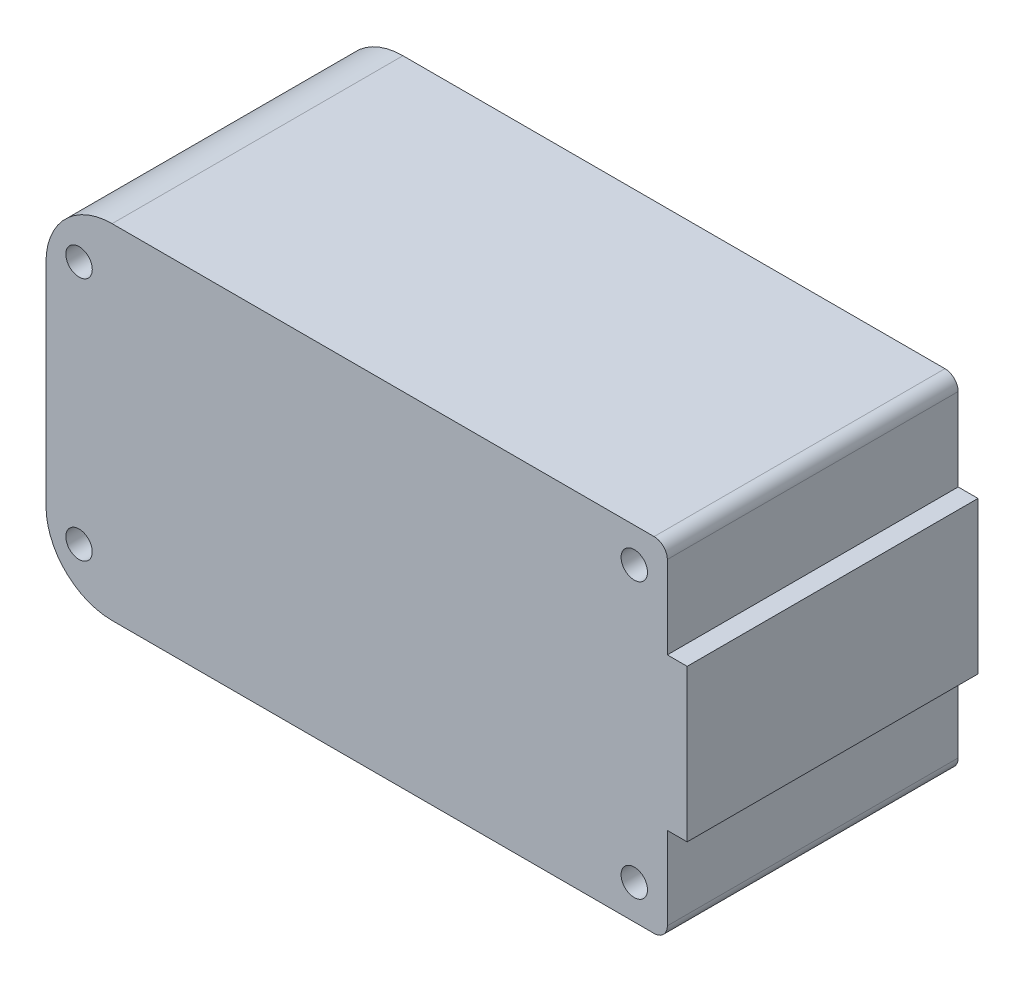
ISO-10303-21;
HEADER;
FILE_DESCRIPTION(('STEP AP214'),'2;1');
FILE_NAME('part.step','',(''),(''),'','','');
FILE_SCHEMA(('AUTOMOTIVE_DESIGN { 1 0 10303 214 1 1 1 1 }'));
ENDSEC;
DATA;
#1=APPLICATION_CONTEXT('core data for automotive mechanical design processes');
#2=APPLICATION_PROTOCOL_DEFINITION('international standard','automotive_design',2000,#1);
#3=PRODUCT_CONTEXT('',#1,'mechanical');
#4=PRODUCT('Part','Part','',(#3));
#5=PRODUCT_RELATED_PRODUCT_CATEGORY('part','',(#4));
#6=PRODUCT_DEFINITION_FORMATION('','',#4);
#7=PRODUCT_DEFINITION_CONTEXT('part definition',#1,'design');
#8=PRODUCT_DEFINITION('design','',#6,#7);
#9=PRODUCT_DEFINITION_SHAPE('','',#8);
#10=(LENGTH_UNIT() NAMED_UNIT(*) SI_UNIT(.MILLI.,.METRE.));
#11=(NAMED_UNIT(*) PLANE_ANGLE_UNIT() SI_UNIT($,.RADIAN.));
#12=(NAMED_UNIT(*) SI_UNIT($,.STERADIAN.) SOLID_ANGLE_UNIT());
#13=UNCERTAINTY_MEASURE_WITH_UNIT(LENGTH_MEASURE(1.E-05),#10,'distance_accuracy_value','');
#14=(GEOMETRIC_REPRESENTATION_CONTEXT(3) GLOBAL_UNCERTAINTY_ASSIGNED_CONTEXT((#13)) GLOBAL_UNIT_ASSIGNED_CONTEXT((#10,
#11,#12)) REPRESENTATION_CONTEXT('',''));
#15=CARTESIAN_POINT('',(0.,0.,0.));
#16=DIRECTION('',(0.,0.,1.));
#17=DIRECTION('',(1.,0.,0.));
#18=AXIS2_PLACEMENT_3D('',#15,#16,#17);
#19=CARTESIAN_POINT('',(0.,0.,11.));
#20=DIRECTION('',(0.,0.,1.));
#21=DIRECTION('',(1.,0.,0.));
#22=AXIS2_PLACEMENT_3D('',#19,#20,#21);
#23=PLANE('',#22);
#24=CARTESIAN_POINT('',(33.,-10.4,11.));
#25=DIRECTION('',(0.,0.,1.));
#26=DIRECTION('',(-1.,0.,0.));
#27=AXIS2_PLACEMENT_3D('',#24,#25,#26);
#28=CIRCLE('',#27,0.999999999999998);
#29=CARTESIAN_POINT('',(32.,-10.4,11.));
#30=VERTEX_POINT('',#29);
#31=EDGE_CURVE('E267',#30,#30,#28,.T.);
#32=ORIENTED_EDGE('',*,*,#31,.F.);
#33=EDGE_LOOP('',(#32));
#34=FACE_BOUND('',#33,.T.);
#35=CARTESIAN_POINT('',(-9.,9.25,11.));
#36=DIRECTION('',(0.,0.,1.));
#37=DIRECTION('',(1.,0.,0.));
#38=AXIS2_PLACEMENT_3D('',#35,#36,#37);
#39=CIRCLE('',#38,1.);
#40=CARTESIAN_POINT('',(-7.99999999999999,9.25,11.));
#41=VERTEX_POINT('',#40);
#42=EDGE_CURVE('E166',#41,#41,#39,.T.);
#43=ORIENTED_EDGE('',*,*,#42,.F.);
#44=EDGE_LOOP('',(#43));
#45=FACE_BOUND('',#44,.T.);
#46=DIRECTION('',(0.,1.,0.));
#47=VECTOR('',#46,1.);
#48=CARTESIAN_POINT('',(35.5,5.75,11.));
#49=LINE('',#48,#47);
#50=CARTESIAN_POINT('',(35.5,5.75,11.));
#51=VERTEX_POINT('',#50);
#52=CARTESIAN_POINT('',(35.5,12.,11.));
#53=VERTEX_POINT('',#52);
#54=EDGE_CURVE('E157',#51,#53,#49,.T.);
#55=ORIENTED_EDGE('',*,*,#54,.T.);
#56=CARTESIAN_POINT('',(34.5,12.,11.));
#57=DIRECTION('',(0.,0.,1.));
#58=DIRECTION('',(1.,0.,0.));
#59=AXIS2_PLACEMENT_3D('',#56,#57,#58);
#60=CIRCLE('',#59,1.);
#61=CARTESIAN_POINT('',(34.5,13.,11.));
#62=VERTEX_POINT('',#61);
#63=EDGE_CURVE('E216',#53,#62,#60,.T.);
#64=ORIENTED_EDGE('',*,*,#63,.T.);
#65=DIRECTION('',(-1.,0.,0.));
#66=VECTOR('',#65,1.);
#67=CARTESIAN_POINT('',(35.5,13.,11.));
#68=LINE('',#67,#66);
#69=CARTESIAN_POINT('',(-6.5,13.,11.));
#70=VERTEX_POINT('',#69);
#71=EDGE_CURVE('E159',#62,#70,#68,.T.);
#72=ORIENTED_EDGE('',*,*,#71,.T.);
#73=CARTESIAN_POINT('',(-6.5,7.99999999999999,11.));
#74=DIRECTION('',(0.,0.,1.));
#75=DIRECTION('',(1.,0.,0.));
#76=AXIS2_PLACEMENT_3D('',#73,#74,#75);
#77=CIRCLE('',#76,5.);
#78=CARTESIAN_POINT('',(-11.5,7.99999999999999,11.));
#79=VERTEX_POINT('',#78);
#80=EDGE_CURVE('E201',#70,#79,#77,.T.);
#81=ORIENTED_EDGE('',*,*,#80,.T.);
#82=DIRECTION('',(0.,-1.,0.));
#83=VECTOR('',#82,1.);
#84=CARTESIAN_POINT('',(-11.5,-13.,11.));
#85=LINE('',#84,#83);
#86=CARTESIAN_POINT('',(-11.5,-8.00000000000001,11.));
#87=VERTEX_POINT('',#86);
#88=EDGE_CURVE('E180',#79,#87,#85,.T.);
#89=ORIENTED_EDGE('',*,*,#88,.T.);
#90=CARTESIAN_POINT('',(-6.5,-8.,11.));
#91=DIRECTION('',(0.,0.,1.));
#92=DIRECTION('',(1.,0.,0.));
#93=AXIS2_PLACEMENT_3D('',#90,#91,#92);
#94=CIRCLE('',#93,5.);
#95=CARTESIAN_POINT('',(-6.5,-13.,11.));
#96=VERTEX_POINT('',#95);
#97=EDGE_CURVE('E199',#87,#96,#94,.T.);
#98=ORIENTED_EDGE('',*,*,#97,.T.);
#99=DIRECTION('',(1.,0.,0.));
#100=VECTOR('',#99,1.);
#101=CARTESIAN_POINT('',(35.5,-13.,11.));
#102=LINE('',#101,#100);
#103=CARTESIAN_POINT('',(34.5,-13.,11.));
#104=VERTEX_POINT('',#103);
#105=EDGE_CURVE('E135',#96,#104,#102,.T.);
#106=ORIENTED_EDGE('',*,*,#105,.T.);
#107=CARTESIAN_POINT('',(34.5,-12.,11.));
#108=DIRECTION('',(0.,0.,1.));
#109=DIRECTION('',(1.,0.,0.));
#110=AXIS2_PLACEMENT_3D('',#107,#108,#109);
#111=CIRCLE('',#110,1.);
#112=CARTESIAN_POINT('',(35.5,-12.,11.));
#113=VERTEX_POINT('',#112);
#114=EDGE_CURVE('E54',#104,#113,#111,.T.);
#115=ORIENTED_EDGE('',*,*,#114,.T.);
#116=DIRECTION('',(0.,1.,0.));
#117=VECTOR('',#116,1.);
#118=CARTESIAN_POINT('',(35.5,-13.,11.));
#119=LINE('',#118,#117);
#120=CARTESIAN_POINT('',(35.5,-5.75,11.));
#121=VERTEX_POINT('',#120);
#122=EDGE_CURVE('E125',#113,#121,#119,.T.);
#123=ORIENTED_EDGE('',*,*,#122,.T.);
#124=DIRECTION('',(1.,0.,0.));
#125=VECTOR('',#124,1.);
#126=CARTESIAN_POINT('',(35.5,-5.75,11.));
#127=LINE('',#126,#125);
#128=CARTESIAN_POINT('',(37.,-5.75,11.));
#129=VERTEX_POINT('',#128);
#130=EDGE_CURVE('E130',#121,#129,#127,.T.);
#131=ORIENTED_EDGE('',*,*,#130,.T.);
#132=DIRECTION('',(0.,1.,0.));
#133=VECTOR('',#132,1.);
#134=CARTESIAN_POINT('',(37.,5.75,11.));
#135=LINE('',#134,#133);
#136=CARTESIAN_POINT('',(37.,5.75,11.));
#137=VERTEX_POINT('',#136);
#138=EDGE_CURVE('E150',#129,#137,#135,.T.);
#139=ORIENTED_EDGE('',*,*,#138,.T.);
#140=DIRECTION('',(-1.,0.,0.));
#141=VECTOR('',#140,1.);
#142=CARTESIAN_POINT('',(35.5,5.75,11.));
#143=LINE('',#142,#141);
#144=EDGE_CURVE('E152',#137,#51,#143,.T.);
#145=ORIENTED_EDGE('',*,*,#144,.T.);
#146=EDGE_LOOP('',(#55,#64,#72,#81,#89,#98,#106,#115,#123,#131,#139,#145));
#147=FACE_BOUND('',#146,.T.);
#148=CARTESIAN_POINT('',(33.,10.4,11.));
#149=DIRECTION('',(0.,0.,1.));
#150=DIRECTION('',(1.,0.,0.));
#151=AXIS2_PLACEMENT_3D('',#148,#149,#150);
#152=CIRCLE('',#151,0.999999999999998);
#153=CARTESIAN_POINT('',(34.,10.4,11.));
#154=VERTEX_POINT('',#153);
#155=EDGE_CURVE('E261',#154,#154,#152,.T.);
#156=ORIENTED_EDGE('',*,*,#155,.F.);
#157=EDGE_LOOP('',(#156));
#158=FACE_BOUND('',#157,.T.);
#159=CARTESIAN_POINT('',(-9.,-9.25,11.));
#160=DIRECTION('',(0.,0.,1.));
#161=DIRECTION('',(-1.,0.,0.));
#162=AXIS2_PLACEMENT_3D('',#159,#160,#161);
#163=CIRCLE('',#162,1.);
#164=CARTESIAN_POINT('',(-10.,-9.25,11.));
#165=VERTEX_POINT('',#164);
#166=EDGE_CURVE('E273',#165,#165,#163,.T.);
#167=ORIENTED_EDGE('',*,*,#166,.F.);
#168=EDGE_LOOP('',(#167));
#169=FACE_BOUND('',#168,.T.);
#170=ADVANCED_FACE('F39',(#34,#45,#147,#158,#169),#23,.T.);
#171=CARTESIAN_POINT('',(0.,0.,-11.));
#172=DIRECTION('',(0.,0.,1.));
#173=DIRECTION('',(1.,0.,0.));
#174=AXIS2_PLACEMENT_3D('',#171,#172,#173);
#175=PLANE('',#174);
#176=CARTESIAN_POINT('',(33.,-10.4,-11.));
#177=DIRECTION('',(0.,0.,1.));
#178=DIRECTION('',(-1.,0.,0.));
#179=AXIS2_PLACEMENT_3D('',#176,#177,#178);
#180=CIRCLE('',#179,0.999999999999998);
#181=CARTESIAN_POINT('',(32.,-10.4,-11.));
#182=VERTEX_POINT('',#181);
#183=EDGE_CURVE('E270',#182,#182,#180,.T.);
#184=ORIENTED_EDGE('',*,*,#183,.T.);
#185=EDGE_LOOP('',(#184));
#186=FACE_BOUND('',#185,.T.);
#187=CARTESIAN_POINT('',(-9.,9.25,-11.));
#188=DIRECTION('',(0.,0.,1.));
#189=DIRECTION('',(1.,0.,0.));
#190=AXIS2_PLACEMENT_3D('',#187,#188,#189);
#191=CIRCLE('',#190,1.);
#192=CARTESIAN_POINT('',(-7.99999999999999,9.25,-11.));
#193=VERTEX_POINT('',#192);
#194=EDGE_CURVE('E258',#193,#193,#191,.T.);
#195=ORIENTED_EDGE('',*,*,#194,.T.);
#196=EDGE_LOOP('',(#195));
#197=FACE_BOUND('',#196,.T.);
#198=DIRECTION('',(-1.,0.,0.));
#199=VECTOR('',#198,1.);
#200=CARTESIAN_POINT('',(35.5,13.,-11.));
#201=LINE('',#200,#199);
#202=CARTESIAN_POINT('',(34.5,13.,-11.));
#203=VERTEX_POINT('',#202);
#204=CARTESIAN_POINT('',(-6.5,13.,-11.));
#205=VERTEX_POINT('',#204);
#206=EDGE_CURVE('E178',#203,#205,#201,.T.);
#207=ORIENTED_EDGE('',*,*,#206,.F.);
#208=CARTESIAN_POINT('',(34.5,12.,-11.));
#209=DIRECTION('',(0.,0.,1.));
#210=DIRECTION('',(1.,0.,0.));
#211=AXIS2_PLACEMENT_3D('',#208,#209,#210);
#212=CIRCLE('',#211,1.);
#213=CARTESIAN_POINT('',(35.5,12.,-11.));
#214=VERTEX_POINT('',#213);
#215=EDGE_CURVE('E211',#203,#214,#212,.F.);
#216=ORIENTED_EDGE('',*,*,#215,.T.);
#217=DIRECTION('',(0.,1.,0.));
#218=VECTOR('',#217,1.);
#219=CARTESIAN_POINT('',(35.5,5.75,-11.));
#220=LINE('',#219,#218);
#221=CARTESIAN_POINT('',(35.5,5.75,-11.));
#222=VERTEX_POINT('',#221);
#223=EDGE_CURVE('E175',#222,#214,#220,.T.);
#224=ORIENTED_EDGE('',*,*,#223,.F.);
#225=DIRECTION('',(-1.,0.,0.));
#226=VECTOR('',#225,1.);
#227=CARTESIAN_POINT('',(35.5,5.75,-11.));
#228=LINE('',#227,#226);
#229=CARTESIAN_POINT('',(37.,5.75,-11.));
#230=VERTEX_POINT('',#229);
#231=EDGE_CURVE('E173',#230,#222,#228,.T.);
#232=ORIENTED_EDGE('',*,*,#231,.F.);
#233=DIRECTION('',(0.,1.,0.));
#234=VECTOR('',#233,1.);
#235=CARTESIAN_POINT('',(37.,5.75,-11.));
#236=LINE('',#235,#234);
#237=CARTESIAN_POINT('',(37.,-5.75,-11.));
#238=VERTEX_POINT('',#237);
#239=EDGE_CURVE('E171',#238,#230,#236,.T.);
#240=ORIENTED_EDGE('',*,*,#239,.F.);
#241=DIRECTION('',(1.,0.,0.));
#242=VECTOR('',#241,1.);
#243=CARTESIAN_POINT('',(35.5,-5.75,-11.));
#244=LINE('',#243,#242);
#245=CARTESIAN_POINT('',(35.5,-5.75,-11.));
#246=VERTEX_POINT('',#245);
#247=EDGE_CURVE('E169',#246,#238,#244,.T.);
#248=ORIENTED_EDGE('',*,*,#247,.F.);
#249=DIRECTION('',(0.,1.,0.));
#250=VECTOR('',#249,1.);
#251=CARTESIAN_POINT('',(35.5,-13.,-11.));
#252=LINE('',#251,#250);
#253=CARTESIAN_POINT('',(35.5,-12.,-11.));
#254=VERTEX_POINT('',#253);
#255=EDGE_CURVE('E141',#254,#246,#252,.T.);
#256=ORIENTED_EDGE('',*,*,#255,.F.);
#257=CARTESIAN_POINT('',(34.5,-12.,-11.));
#258=DIRECTION('',(0.,0.,1.));
#259=DIRECTION('',(1.,0.,0.));
#260=AXIS2_PLACEMENT_3D('',#257,#258,#259);
#261=CIRCLE('',#260,1.);
#262=CARTESIAN_POINT('',(34.5,-13.,-11.));
#263=VERTEX_POINT('',#262);
#264=EDGE_CURVE('E209',#254,#263,#261,.F.);
#265=ORIENTED_EDGE('',*,*,#264,.T.);
#266=DIRECTION('',(1.,0.,0.));
#267=VECTOR('',#266,1.);
#268=CARTESIAN_POINT('',(35.5,-13.,-11.));
#269=LINE('',#268,#267);
#270=CARTESIAN_POINT('',(-6.5,-13.,-11.));
#271=VERTEX_POINT('',#270);
#272=EDGE_CURVE('E165',#271,#263,#269,.T.);
#273=ORIENTED_EDGE('',*,*,#272,.F.);
#274=CARTESIAN_POINT('',(-6.5,-8.,-11.));
#275=DIRECTION('',(0.,0.,1.));
#276=DIRECTION('',(1.,0.,0.));
#277=AXIS2_PLACEMENT_3D('',#274,#275,#276);
#278=CIRCLE('',#277,5.);
#279=CARTESIAN_POINT('',(-11.5,-8.00000000000001,-11.));
#280=VERTEX_POINT('',#279);
#281=EDGE_CURVE('E191',#271,#280,#278,.F.);
#282=ORIENTED_EDGE('',*,*,#281,.T.);
#283=DIRECTION('',(0.,-1.,0.));
#284=VECTOR('',#283,1.);
#285=CARTESIAN_POINT('',(-11.5,-13.,-11.));
#286=LINE('',#285,#284);
#287=CARTESIAN_POINT('',(-11.5,7.99999999999999,-11.));
#288=VERTEX_POINT('',#287);
#289=EDGE_CURVE('E162',#288,#280,#286,.T.);
#290=ORIENTED_EDGE('',*,*,#289,.F.);
#291=CARTESIAN_POINT('',(-6.5,7.99999999999999,-11.));
#292=DIRECTION('',(0.,0.,1.));
#293=DIRECTION('',(1.,0.,0.));
#294=AXIS2_PLACEMENT_3D('',#291,#292,#293);
#295=CIRCLE('',#294,5.);
#296=EDGE_CURVE('E193',#288,#205,#295,.F.);
#297=ORIENTED_EDGE('',*,*,#296,.T.);
#298=EDGE_LOOP('',(#207,#216,#224,#232,#240,#248,#256,#265,#273,#282,#290,#297));
#299=FACE_BOUND('',#298,.T.);
#300=CARTESIAN_POINT('',(33.,10.4,-11.));
#301=DIRECTION('',(0.,0.,1.));
#302=DIRECTION('',(1.,0.,0.));
#303=AXIS2_PLACEMENT_3D('',#300,#301,#302);
#304=CIRCLE('',#303,0.999999999999998);
#305=CARTESIAN_POINT('',(34.,10.4,-11.));
#306=VERTEX_POINT('',#305);
#307=EDGE_CURVE('E264',#306,#306,#304,.T.);
#308=ORIENTED_EDGE('',*,*,#307,.T.);
#309=EDGE_LOOP('',(#308));
#310=FACE_BOUND('',#309,.T.);
#311=CARTESIAN_POINT('',(-9.,-9.25,-11.));
#312=DIRECTION('',(0.,0.,1.));
#313=DIRECTION('',(-1.,0.,0.));
#314=AXIS2_PLACEMENT_3D('',#311,#312,#313);
#315=CIRCLE('',#314,1.);
#316=CARTESIAN_POINT('',(-10.,-9.25,-11.));
#317=VERTEX_POINT('',#316);
#318=EDGE_CURVE('E276',#317,#317,#315,.T.);
#319=ORIENTED_EDGE('',*,*,#318,.T.);
#320=EDGE_LOOP('',(#319));
#321=FACE_BOUND('',#320,.T.);
#322=ADVANCED_FACE('F220',(#186,#197,#299,#310,#321),#175,.F.);
#323=CARTESIAN_POINT('',(-11.5,-13.,11.));
#324=DIRECTION('',(1.,0.,0.));
#325=DIRECTION('',(0.,1.,0.));
#326=AXIS2_PLACEMENT_3D('',#323,#324,#325);
#327=PLANE('',#326);
#328=ORIENTED_EDGE('',*,*,#88,.F.);
#329=DIRECTION('',(0.,0.,-1.));
#330=VECTOR('',#329,1.);
#331=CARTESIAN_POINT('',(-11.5,7.99999999999999,11.));
#332=LINE('',#331,#330);
#333=EDGE_CURVE('E188',#79,#288,#332,.T.);
#334=ORIENTED_EDGE('',*,*,#333,.T.);
#335=ORIENTED_EDGE('',*,*,#289,.T.);
#336=DIRECTION('',(0.,0.,-1.));
#337=VECTOR('',#336,1.);
#338=CARTESIAN_POINT('',(-11.5,-8.,11.));
#339=LINE('',#338,#337);
#340=EDGE_CURVE('E144',#280,#87,#339,.F.);
#341=ORIENTED_EDGE('',*,*,#340,.T.);
#342=EDGE_LOOP('',(#328,#334,#335,#341));
#343=FACE_BOUND('',#342,.T.);
#344=ADVANCED_FACE('F253',(#343),#327,.F.);
#345=CARTESIAN_POINT('',(35.5,-13.,11.));
#346=DIRECTION('',(0.,1.,0.));
#347=DIRECTION('',(-1.,0.,0.));
#348=AXIS2_PLACEMENT_3D('',#345,#346,#347);
#349=PLANE('',#348);
#350=ORIENTED_EDGE('',*,*,#272,.T.);
#351=DIRECTION('',(0.,0.,-1.));
#352=VECTOR('',#351,1.);
#353=CARTESIAN_POINT('',(34.5,-13.,11.));
#354=LINE('',#353,#352);
#355=EDGE_CURVE('E11',#263,#104,#354,.F.);
#356=ORIENTED_EDGE('',*,*,#355,.T.);
#357=ORIENTED_EDGE('',*,*,#105,.F.);
#358=DIRECTION('',(0.,0.,-1.));
#359=VECTOR('',#358,1.);
#360=CARTESIAN_POINT('',(-6.5,-13.,11.));
#361=LINE('',#360,#359);
#362=EDGE_CURVE('E203',#96,#271,#361,.T.);
#363=ORIENTED_EDGE('',*,*,#362,.T.);
#364=EDGE_LOOP('',(#350,#356,#357,#363));
#365=FACE_BOUND('',#364,.T.);
#366=ADVANCED_FACE('F312',(#365),#349,.F.);
#367=CARTESIAN_POINT('',(35.5,-13.,11.));
#368=DIRECTION('',(-1.,0.,0.));
#369=DIRECTION('',(0.,0.,1.));
#370=AXIS2_PLACEMENT_3D('',#367,#368,#369);
#371=PLANE('',#370);
#372=ORIENTED_EDGE('',*,*,#122,.F.);
#373=DIRECTION('',(0.,0.,-1.));
#374=VECTOR('',#373,1.);
#375=CARTESIAN_POINT('',(35.5,-12.,11.));
#376=LINE('',#375,#374);
#377=EDGE_CURVE('E47',#113,#254,#376,.T.);
#378=ORIENTED_EDGE('',*,*,#377,.T.);
#379=ORIENTED_EDGE('',*,*,#255,.T.);
#380=DIRECTION('',(0.,0.,-1.));
#381=VECTOR('',#380,1.);
#382=CARTESIAN_POINT('',(35.5,-5.75,11.));
#383=LINE('',#382,#381);
#384=EDGE_CURVE('E138',#121,#246,#383,.T.);
#385=ORIENTED_EDGE('',*,*,#384,.F.);
#386=EDGE_LOOP('',(#372,#378,#379,#385));
#387=FACE_BOUND('',#386,.T.);
#388=ADVANCED_FACE('F139',(#387),#371,.F.);
#389=CARTESIAN_POINT('',(35.5,-5.75,11.));
#390=DIRECTION('',(0.,1.,0.));
#391=DIRECTION('',(0.,0.,1.));
#392=AXIS2_PLACEMENT_3D('',#389,#390,#391);
#393=PLANE('',#392);
#394=ORIENTED_EDGE('',*,*,#247,.T.);
#395=DIRECTION('',(0.,0.,-1.));
#396=VECTOR('',#395,1.);
#397=CARTESIAN_POINT('',(37.,-5.75,11.));
#398=LINE('',#397,#396);
#399=EDGE_CURVE('E145',#129,#238,#398,.T.);
#400=ORIENTED_EDGE('',*,*,#399,.F.);
#401=ORIENTED_EDGE('',*,*,#130,.F.);
#402=ORIENTED_EDGE('',*,*,#384,.T.);
#403=EDGE_LOOP('',(#394,#400,#401,#402));
#404=FACE_BOUND('',#403,.T.);
#405=ADVANCED_FACE('F147',(#404),#393,.F.);
#406=CARTESIAN_POINT('',(37.,5.75,11.));
#407=DIRECTION('',(-1.,0.,0.));
#408=DIRECTION('',(0.,0.,1.));
#409=AXIS2_PLACEMENT_3D('',#406,#407,#408);
#410=PLANE('',#409);
#411=ORIENTED_EDGE('',*,*,#239,.T.);
#412=DIRECTION('',(0.,0.,-1.));
#413=VECTOR('',#412,1.);
#414=CARTESIAN_POINT('',(37.,5.75,11.));
#415=LINE('',#414,#413);
#416=EDGE_CURVE('E183',#137,#230,#415,.T.);
#417=ORIENTED_EDGE('',*,*,#416,.F.);
#418=ORIENTED_EDGE('',*,*,#138,.F.);
#419=ORIENTED_EDGE('',*,*,#399,.T.);
#420=EDGE_LOOP('',(#411,#417,#418,#419));
#421=FACE_BOUND('',#420,.T.);
#422=ADVANCED_FACE('F226',(#421),#410,.F.);
#423=CARTESIAN_POINT('',(35.5,5.75,11.));
#424=DIRECTION('',(0.,-1.,0.));
#425=DIRECTION('',(0.,0.,-1.));
#426=AXIS2_PLACEMENT_3D('',#423,#424,#425);
#427=PLANE('',#426);
#428=ORIENTED_EDGE('',*,*,#231,.T.);
#429=DIRECTION('',(0.,0.,-1.));
#430=VECTOR('',#429,1.);
#431=CARTESIAN_POINT('',(35.5,5.75,11.));
#432=LINE('',#431,#430);
#433=EDGE_CURVE('E161',#51,#222,#432,.T.);
#434=ORIENTED_EDGE('',*,*,#433,.F.);
#435=ORIENTED_EDGE('',*,*,#144,.F.);
#436=ORIENTED_EDGE('',*,*,#416,.T.);
#437=EDGE_LOOP('',(#428,#434,#435,#436));
#438=FACE_BOUND('',#437,.T.);
#439=ADVANCED_FACE('F233',(#438),#427,.F.);
#440=CARTESIAN_POINT('',(35.5,5.75,11.));
#441=DIRECTION('',(-1.,0.,0.));
#442=DIRECTION('',(0.,0.,1.));
#443=AXIS2_PLACEMENT_3D('',#440,#441,#442);
#444=PLANE('',#443);
#445=ORIENTED_EDGE('',*,*,#223,.T.);
#446=DIRECTION('',(0.,0.,-1.));
#447=VECTOR('',#446,1.);
#448=CARTESIAN_POINT('',(35.5,12.,11.));
#449=LINE('',#448,#447);
#450=EDGE_CURVE('E213',#214,#53,#449,.F.);
#451=ORIENTED_EDGE('',*,*,#450,.T.);
#452=ORIENTED_EDGE('',*,*,#54,.F.);
#453=ORIENTED_EDGE('',*,*,#433,.T.);
#454=EDGE_LOOP('',(#445,#451,#452,#453));
#455=FACE_BOUND('',#454,.T.);
#456=ADVANCED_FACE('F236',(#455),#444,.F.);
#457=CARTESIAN_POINT('',(35.5,13.,11.));
#458=DIRECTION('',(0.,-1.,0.));
#459=DIRECTION('',(1.,0.,0.));
#460=AXIS2_PLACEMENT_3D('',#457,#458,#459);
#461=PLANE('',#460);
#462=ORIENTED_EDGE('',*,*,#71,.F.);
#463=DIRECTION('',(0.,0.,-1.));
#464=VECTOR('',#463,1.);
#465=CARTESIAN_POINT('',(34.5,13.,11.));
#466=LINE('',#465,#464);
#467=EDGE_CURVE('E206',#62,#203,#466,.T.);
#468=ORIENTED_EDGE('',*,*,#467,.T.);
#469=ORIENTED_EDGE('',*,*,#206,.T.);
#470=DIRECTION('',(0.,0.,-1.));
#471=VECTOR('',#470,1.);
#472=CARTESIAN_POINT('',(-6.5,13.,11.));
#473=LINE('',#472,#471);
#474=EDGE_CURVE('E196',#205,#70,#473,.F.);
#475=ORIENTED_EDGE('',*,*,#474,.T.);
#476=EDGE_LOOP('',(#462,#468,#469,#475));
#477=FACE_BOUND('',#476,.T.);
#478=ADVANCED_FACE('F243',(#477),#461,.F.);
#479=CARTESIAN_POINT('',(-9.,9.25,11.));
#480=DIRECTION('',(0.,0.,-1.));
#481=DIRECTION('',(-1.,0.,0.));
#482=AXIS2_PLACEMENT_3D('',#479,#480,#481);
#483=CYLINDRICAL_SURFACE('',#482,1.);
#484=ORIENTED_EDGE('',*,*,#42,.T.);
#485=EDGE_LOOP('',(#484));
#486=FACE_BOUND('',#485,.T.);
#487=ORIENTED_EDGE('',*,*,#194,.F.);
#488=EDGE_LOOP('',(#487));
#489=FACE_BOUND('',#488,.T.);
#490=ADVANCED_FACE('F297',(#486,#489),#483,.F.);
#491=CARTESIAN_POINT('',(33.,10.4,11.));
#492=DIRECTION('',(0.,0.,-1.));
#493=DIRECTION('',(-1.,0.,0.));
#494=AXIS2_PLACEMENT_3D('',#491,#492,#493);
#495=CYLINDRICAL_SURFACE('',#494,0.999999999999998);
#496=ORIENTED_EDGE('',*,*,#155,.T.);
#497=EDGE_LOOP('',(#496));
#498=FACE_BOUND('',#497,.T.);
#499=ORIENTED_EDGE('',*,*,#307,.F.);
#500=EDGE_LOOP('',(#499));
#501=FACE_BOUND('',#500,.T.);
#502=ADVANCED_FACE('F351',(#498,#501),#495,.F.);
#503=CARTESIAN_POINT('',(33.,-10.4,11.));
#504=DIRECTION('',(0.,0.,-1.));
#505=DIRECTION('',(-1.,0.,0.));
#506=AXIS2_PLACEMENT_3D('',#503,#504,#505);
#507=CYLINDRICAL_SURFACE('',#506,0.999999999999998);
#508=ORIENTED_EDGE('',*,*,#31,.T.);
#509=EDGE_LOOP('',(#508));
#510=FACE_BOUND('',#509,.T.);
#511=ORIENTED_EDGE('',*,*,#183,.F.);
#512=EDGE_LOOP('',(#511));
#513=FACE_BOUND('',#512,.T.);
#514=ADVANCED_FACE('F344',(#510,#513),#507,.F.);
#515=CARTESIAN_POINT('',(-9.,-9.25,11.));
#516=DIRECTION('',(0.,0.,-1.));
#517=DIRECTION('',(-1.,0.,0.));
#518=AXIS2_PLACEMENT_3D('',#515,#516,#517);
#519=CYLINDRICAL_SURFACE('',#518,1.);
#520=ORIENTED_EDGE('',*,*,#166,.T.);
#521=EDGE_LOOP('',(#520));
#522=FACE_BOUND('',#521,.T.);
#523=ORIENTED_EDGE('',*,*,#318,.F.);
#524=EDGE_LOOP('',(#523));
#525=FACE_BOUND('',#524,.T.);
#526=ADVANCED_FACE('F282',(#522,#525),#519,.F.);
#527=CARTESIAN_POINT('',(-6.5,7.99999999999999,11.));
#528=DIRECTION('',(0.,0.,-1.));
#529=DIRECTION('',(-1.,0.,0.));
#530=AXIS2_PLACEMENT_3D('',#527,#528,#529);
#531=CYLINDRICAL_SURFACE('',#530,5.);
#532=ORIENTED_EDGE('',*,*,#80,.F.);
#533=ORIENTED_EDGE('',*,*,#474,.F.);
#534=ORIENTED_EDGE('',*,*,#296,.F.);
#535=ORIENTED_EDGE('',*,*,#333,.F.);
#536=EDGE_LOOP('',(#532,#533,#534,#535));
#537=FACE_BOUND('',#536,.T.);
#538=ADVANCED_FACE('F248',(#537),#531,.T.);
#539=CARTESIAN_POINT('',(-6.5,-8.,11.));
#540=DIRECTION('',(0.,0.,-1.));
#541=DIRECTION('',(-1.,0.,0.));
#542=AXIS2_PLACEMENT_3D('',#539,#540,#541);
#543=CYLINDRICAL_SURFACE('',#542,5.);
#544=ORIENTED_EDGE('',*,*,#97,.F.);
#545=ORIENTED_EDGE('',*,*,#340,.F.);
#546=ORIENTED_EDGE('',*,*,#281,.F.);
#547=ORIENTED_EDGE('',*,*,#362,.F.);
#548=EDGE_LOOP('',(#544,#545,#546,#547));
#549=FACE_BOUND('',#548,.T.);
#550=ADVANCED_FACE('F319',(#549),#543,.T.);
#551=CARTESIAN_POINT('',(34.5,12.,11.));
#552=DIRECTION('',(0.,0.,-1.));
#553=DIRECTION('',(-1.,0.,0.));
#554=AXIS2_PLACEMENT_3D('',#551,#552,#553);
#555=CYLINDRICAL_SURFACE('',#554,1.);
#556=ORIENTED_EDGE('',*,*,#63,.F.);
#557=ORIENTED_EDGE('',*,*,#450,.F.);
#558=ORIENTED_EDGE('',*,*,#215,.F.);
#559=ORIENTED_EDGE('',*,*,#467,.F.);
#560=EDGE_LOOP('',(#556,#557,#558,#559));
#561=FACE_BOUND('',#560,.T.);
#562=ADVANCED_FACE('F239',(#561),#555,.T.);
#563=CARTESIAN_POINT('',(34.5,-12.,11.));
#564=DIRECTION('',(0.,0.,-1.));
#565=DIRECTION('',(-1.,0.,0.));
#566=AXIS2_PLACEMENT_3D('',#563,#564,#565);
#567=CYLINDRICAL_SURFACE('',#566,1.);
#568=ORIENTED_EDGE('',*,*,#114,.F.);
#569=ORIENTED_EDGE('',*,*,#355,.F.);
#570=ORIENTED_EDGE('',*,*,#264,.F.);
#571=ORIENTED_EDGE('',*,*,#377,.F.);
#572=EDGE_LOOP('',(#568,#569,#570,#571));
#573=FACE_BOUND('',#572,.T.);
#574=ADVANCED_FACE('F41',(#573),#567,.T.);
#575=CLOSED_SHELL('',(#170,#322,#344,#366,#388,#405,#422,#439,#456,#478,#490,#502,#514,#526,
#538,#550,#562,#574));
#576=MANIFOLD_SOLID_BREP('B2',#575);
#577=ADVANCED_BREP_SHAPE_REPRESENTATION('',(#18,#576),#14);
#578=SHAPE_DEFINITION_REPRESENTATION(#9,#577);
ENDSEC;
END-ISO-10303-21;
